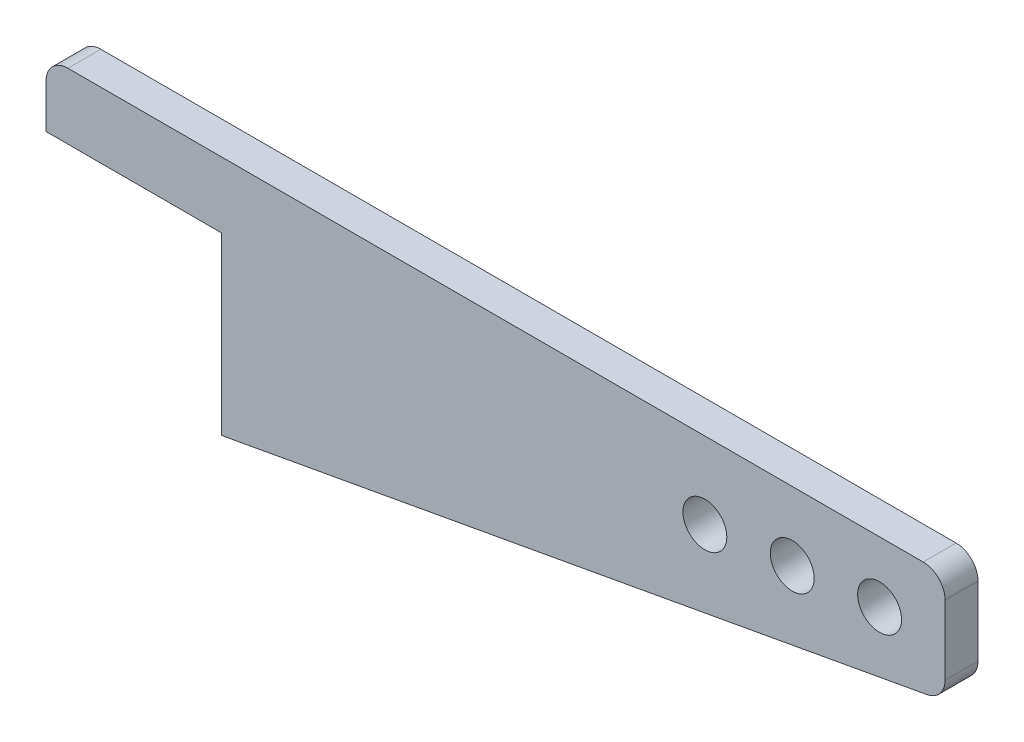
ISO-10303-21;
HEADER;
FILE_DESCRIPTION(('STEP AP214'),'2;1');
FILE_NAME('part.step','',(''),(''),'','','');
FILE_SCHEMA(('AUTOMOTIVE_DESIGN { 1 0 10303 214 1 1 1 1 }'));
ENDSEC;
DATA;
#1=APPLICATION_CONTEXT('core data for automotive mechanical design processes');
#2=APPLICATION_PROTOCOL_DEFINITION('international standard','automotive_design',2000,#1);
#3=PRODUCT_CONTEXT('',#1,'mechanical');
#4=PRODUCT('Part','Part','',(#3));
#5=PRODUCT_RELATED_PRODUCT_CATEGORY('part','',(#4));
#6=PRODUCT_DEFINITION_FORMATION('','',#4);
#7=PRODUCT_DEFINITION_CONTEXT('part definition',#1,'design');
#8=PRODUCT_DEFINITION('design','',#6,#7);
#9=PRODUCT_DEFINITION_SHAPE('','',#8);
#10=(LENGTH_UNIT() NAMED_UNIT(*) SI_UNIT(.MILLI.,.METRE.));
#11=(NAMED_UNIT(*) PLANE_ANGLE_UNIT() SI_UNIT($,.RADIAN.));
#12=(NAMED_UNIT(*) SI_UNIT($,.STERADIAN.) SOLID_ANGLE_UNIT());
#13=UNCERTAINTY_MEASURE_WITH_UNIT(LENGTH_MEASURE(1.E-05),#10,'distance_accuracy_value','');
#14=(GEOMETRIC_REPRESENTATION_CONTEXT(3) GLOBAL_UNCERTAINTY_ASSIGNED_CONTEXT((#13)) GLOBAL_UNIT_ASSIGNED_CONTEXT((#10,
#11,#12)) REPRESENTATION_CONTEXT('',''));
#15=CARTESIAN_POINT('',(0.,0.,0.));
#16=DIRECTION('',(0.,0.,1.));
#17=DIRECTION('',(1.,0.,0.));
#18=AXIS2_PLACEMENT_3D('',#15,#16,#17);
#19=CARTESIAN_POINT('',(-3.33066907387547E-13,-1.77635683940025E-12,15.));
#20=DIRECTION('',(0.,0.,-1.));
#21=DIRECTION('',(-1.,0.,0.));
#22=AXIS2_PLACEMENT_3D('',#19,#20,#21);
#23=PLANE('',#22);
#24=DIRECTION('',(-1.,0.,0.));
#25=VECTOR('',#24,1.);
#26=CARTESIAN_POINT('',(-3.33066907387547E-13,-1.77635683940025E-12,15.));
#27=LINE('',#26,#25);
#28=CARTESIAN_POINT('',(400.,-5.10702591327572E-12,15.));
#29=VERTEX_POINT('',#28);
#30=CARTESIAN_POINT('',(9.99999999999968,-3.10862446895044E-12,15.));
#31=VERTEX_POINT('',#30);
#32=EDGE_CURVE('E201',#29,#31,#27,.T.);
#33=ORIENTED_EDGE('',*,*,#32,.T.);
#34=CARTESIAN_POINT('',(9.99999999999973,-10.0000000000031,14.9999999999996));
#35=DIRECTION('',(0.,0.,-1.));
#36=DIRECTION('',(-1.,0.,0.));
#37=AXIS2_PLACEMENT_3D('',#34,#35,#36);
#38=CIRCLE('',#37,10.);
#39=CARTESIAN_POINT('',(-3.33066907387547E-13,-10.0000000000018,15.));
#40=VERTEX_POINT('',#39);
#41=EDGE_CURVE('E138',#31,#40,#38,.F.);
#42=ORIENTED_EDGE('',*,*,#41,.T.);
#43=DIRECTION('',(0.,-1.,0.));
#44=VECTOR('',#43,1.);
#45=CARTESIAN_POINT('',(0.,-30.0000000000018,15.));
#46=LINE('',#45,#44);
#47=CARTESIAN_POINT('',(0.,-30.0000000000018,15.));
#48=VERTEX_POINT('',#47);
#49=EDGE_CURVE('E131',#40,#48,#46,.T.);
#50=ORIENTED_EDGE('',*,*,#49,.T.);
#51=DIRECTION('',(1.,0.,0.));
#52=VECTOR('',#51,1.);
#53=CARTESIAN_POINT('',(79.9999999999998,-30.0000000000039,15.0000000000001));
#54=LINE('',#53,#52);
#55=CARTESIAN_POINT('',(79.9999999999998,-30.0000000000039,15.0000000000001));
#56=VERTEX_POINT('',#55);
#57=EDGE_CURVE('E135',#48,#56,#54,.T.);
#58=ORIENTED_EDGE('',*,*,#57,.T.);
#59=DIRECTION('',(0.,-1.,0.));
#60=VECTOR('',#59,1.);
#61=CARTESIAN_POINT('',(80.,-110.000000000004,14.9999999999998));
#62=LINE('',#61,#60);
#63=CARTESIAN_POINT('',(80.,-110.000000000004,14.9999999999998));
#64=VERTEX_POINT('',#63);
#65=EDGE_CURVE('E152',#56,#64,#62,.T.);
#66=ORIENTED_EDGE('',*,*,#65,.T.);
#67=DIRECTION('',(0.983869910099908,0.178885438199983,0.));
#68=VECTOR('',#67,1.);
#69=CARTESIAN_POINT('',(410.,-50.000000000005,14.9999999999996));
#70=LINE('',#69,#68);
#71=CARTESIAN_POINT('',(401.788854382,-51.4929355669123,15.0000000000003));
#72=VERTEX_POINT('',#71);
#73=EDGE_CURVE('E207',#64,#72,#70,.T.);
#74=ORIENTED_EDGE('',*,*,#73,.T.);
#75=CARTESIAN_POINT('',(400.,-41.6542364659151,15.0000000000001));
#76=DIRECTION('',(0.,0.,-1.));
#77=DIRECTION('',(-1.,0.,0.));
#78=AXIS2_PLACEMENT_3D('',#75,#76,#77);
#79=CIRCLE('',#78,10.);
#80=CARTESIAN_POINT('',(410.,-41.6542364659151,15.));
#81=VERTEX_POINT('',#80);
#82=EDGE_CURVE('E83',#72,#81,#79,.F.);
#83=ORIENTED_EDGE('',*,*,#82,.T.);
#84=DIRECTION('',(0.,1.,0.));
#85=VECTOR('',#84,1.);
#86=CARTESIAN_POINT('',(410.,-5.10702591327572E-12,15.0000000000001));
#87=LINE('',#86,#85);
#88=CARTESIAN_POINT('',(410.,-10.000000000005,14.9999999999999));
#89=VERTEX_POINT('',#88);
#90=EDGE_CURVE('E185',#81,#89,#87,.T.);
#91=ORIENTED_EDGE('',*,*,#90,.T.);
#92=CARTESIAN_POINT('',(400.,-10.0000000000051,15.0000000000001));
#93=DIRECTION('',(0.,0.,-1.));
#94=DIRECTION('',(-1.,0.,0.));
#95=AXIS2_PLACEMENT_3D('',#92,#93,#94);
#96=CIRCLE('',#95,10.);
#97=EDGE_CURVE('E176',#89,#29,#96,.F.);
#98=ORIENTED_EDGE('',*,*,#97,.T.);
#99=EDGE_LOOP('',(#33,#42,#50,#58,#66,#74,#83,#91,#98));
#100=FACE_BOUND('',#99,.T.);
#101=CARTESIAN_POINT('',(300.451747288552,-34.9589320646788,15.));
#102=DIRECTION('',(0.,0.,1.));
#103=DIRECTION('',(1.,0.,0.));
#104=AXIS2_PLACEMENT_3D('',#101,#102,#103);
#105=CIRCLE('',#104,9.99999999999998);
#106=CARTESIAN_POINT('',(310.451747288552,-34.9589320646788,15.));
#107=VERTEX_POINT('',#106);
#108=EDGE_CURVE('E213',#107,#107,#105,.T.);
#109=ORIENTED_EDGE('',*,*,#108,.F.);
#110=EDGE_LOOP('',(#109));
#111=FACE_BOUND('',#110,.T.);
#112=CARTESIAN_POINT('',(340.287475547261,-31.337502222978,15.));
#113=DIRECTION('',(0.,0.,1.));
#114=DIRECTION('',(1.,0.,0.));
#115=AXIS2_PLACEMENT_3D('',#112,#113,#114);
#116=CIRCLE('',#115,9.99999999999998);
#117=CARTESIAN_POINT('',(350.287475547261,-31.337502222978,15.));
#118=VERTEX_POINT('',#117);
#119=EDGE_CURVE('E322',#118,#118,#116,.T.);
#120=ORIENTED_EDGE('',*,*,#119,.F.);
#121=EDGE_LOOP('',(#120));
#122=FACE_BOUND('',#121,.T.);
#123=CARTESIAN_POINT('',(380.123203805969,-27.7160723812786,15.));
#124=DIRECTION('',(0.,0.,1.));
#125=DIRECTION('',(1.,0.,0.));
#126=AXIS2_PLACEMENT_3D('',#123,#124,#125);
#127=CIRCLE('',#126,10.);
#128=CARTESIAN_POINT('',(390.123203805969,-27.7160723812786,15.));
#129=VERTEX_POINT('',#128);
#130=EDGE_CURVE('E313',#129,#129,#127,.T.);
#131=ORIENTED_EDGE('',*,*,#130,.F.);
#132=EDGE_LOOP('',(#131));
#133=FACE_BOUND('',#132,.T.);
#134=ADVANCED_FACE('F61',(#100,#111,#122,#133),#23,.F.);
#135=CARTESIAN_POINT('',(0.,0.,0.));
#136=DIRECTION('',(0.,0.,-1.));
#137=DIRECTION('',(-1.,0.,0.));
#138=AXIS2_PLACEMENT_3D('',#135,#136,#137);
#139=PLANE('',#138);
#140=CARTESIAN_POINT('',(340.28747554726,-31.3375022229763,0.));
#141=DIRECTION('',(0.,0.,1.));
#142=DIRECTION('',(1.,0.,0.));
#143=AXIS2_PLACEMENT_3D('',#140,#141,#142);
#144=CIRCLE('',#143,9.99999999999998);
#145=CARTESIAN_POINT('',(350.28747554726,-31.3375022229763,0.));
#146=VERTEX_POINT('',#145);
#147=EDGE_CURVE('E319',#146,#146,#144,.T.);
#148=ORIENTED_EDGE('',*,*,#147,.T.);
#149=EDGE_LOOP('',(#148));
#150=FACE_BOUND('',#149,.T.);
#151=DIRECTION('',(0.,-1.,0.));
#152=VECTOR('',#151,1.);
#153=CARTESIAN_POINT('',(0.,-30.,0.));
#154=LINE('',#153,#152);
#155=CARTESIAN_POINT('',(0.,-10.,0.));
#156=VERTEX_POINT('',#155);
#157=CARTESIAN_POINT('',(0.,-30.,0.));
#158=VERTEX_POINT('',#157);
#159=EDGE_CURVE('E156',#156,#158,#154,.T.);
#160=ORIENTED_EDGE('',*,*,#159,.F.);
#161=CARTESIAN_POINT('',(10.0000000000001,-10.0000000000013,0.));
#162=DIRECTION('',(0.,0.,-1.));
#163=DIRECTION('',(-1.,0.,0.));
#164=AXIS2_PLACEMENT_3D('',#161,#162,#163);
#165=CIRCLE('',#164,10.);
#166=CARTESIAN_POINT('',(10.0000000000001,-1.33226762955019E-12,0.));
#167=VERTEX_POINT('',#166);
#168=EDGE_CURVE('E169',#156,#167,#165,.T.);
#169=ORIENTED_EDGE('',*,*,#168,.T.);
#170=DIRECTION('',(-1.,0.,0.));
#171=VECTOR('',#170,1.);
#172=CARTESIAN_POINT('',(0.,0.,0.));
#173=LINE('',#172,#171);
#174=CARTESIAN_POINT('',(399.999999999999,-3.33066907387547E-12,0.));
#175=VERTEX_POINT('',#174);
#176=EDGE_CURVE('E143',#175,#167,#173,.T.);
#177=ORIENTED_EDGE('',*,*,#176,.F.);
#178=CARTESIAN_POINT('',(399.999999999999,-10.0000000000033,4.44089209850063E-13));
#179=DIRECTION('',(0.,0.,-1.));
#180=DIRECTION('',(-1.,0.,0.));
#181=AXIS2_PLACEMENT_3D('',#178,#179,#180);
#182=CIRCLE('',#181,10.);
#183=CARTESIAN_POINT('',(409.999999999999,-10.0000000000033,0.));
#184=VERTEX_POINT('',#183);
#185=EDGE_CURVE('E160',#175,#184,#182,.T.);
#186=ORIENTED_EDGE('',*,*,#185,.T.);
#187=DIRECTION('',(0.,1.,0.));
#188=VECTOR('',#187,1.);
#189=CARTESIAN_POINT('',(409.999999999999,-3.33066907387547E-12,4.44089209850063E-13));
#190=LINE('',#189,#188);
#191=CARTESIAN_POINT('',(410.,-41.6542364659134,0.));
#192=VERTEX_POINT('',#191);
#193=EDGE_CURVE('E184',#192,#184,#190,.T.);
#194=ORIENTED_EDGE('',*,*,#193,.F.);
#195=CARTESIAN_POINT('',(400.,-41.6542364659134,4.44089209850063E-13));
#196=DIRECTION('',(0.,0.,-1.));
#197=DIRECTION('',(-1.,0.,0.));
#198=AXIS2_PLACEMENT_3D('',#195,#196,#197);
#199=CIRCLE('',#198,10.);
#200=CARTESIAN_POINT('',(401.788854381999,-51.4929355669105,2.77555756156289E-13));
#201=VERTEX_POINT('',#200);
#202=EDGE_CURVE('E167',#192,#201,#199,.T.);
#203=ORIENTED_EDGE('',*,*,#202,.T.);
#204=DIRECTION('',(0.983869910099908,0.178885438199983,0.));
#205=VECTOR('',#204,1.);
#206=CARTESIAN_POINT('',(410.,-50.0000000000033,0.));
#207=LINE('',#206,#205);
#208=CARTESIAN_POINT('',(80.0000000000001,-110.000000000003,0.));
#209=VERTEX_POINT('',#208);
#210=EDGE_CURVE('E193',#209,#201,#207,.T.);
#211=ORIENTED_EDGE('',*,*,#210,.F.);
#212=DIRECTION('',(0.,-1.,0.));
#213=VECTOR('',#212,1.);
#214=CARTESIAN_POINT('',(80.0000000000001,-110.000000000003,0.));
#215=LINE('',#214,#213);
#216=CARTESIAN_POINT('',(79.9999999999999,-30.0000000000032,0.));
#217=VERTEX_POINT('',#216);
#218=EDGE_CURVE('E197',#217,#209,#215,.T.);
#219=ORIENTED_EDGE('',*,*,#218,.F.);
#220=DIRECTION('',(1.,0.,0.));
#221=VECTOR('',#220,1.);
#222=CARTESIAN_POINT('',(79.9999999999999,-30.0000000000032,0.));
#223=LINE('',#222,#221);
#224=EDGE_CURVE('E212',#158,#217,#223,.T.);
#225=ORIENTED_EDGE('',*,*,#224,.F.);
#226=EDGE_LOOP('',(#160,#169,#177,#186,#194,#203,#211,#219,#225));
#227=FACE_BOUND('',#226,.T.);
#228=CARTESIAN_POINT('',(300.451747288551,-34.958932064677,0.));
#229=DIRECTION('',(0.,0.,1.));
#230=DIRECTION('',(1.,0.,0.));
#231=AXIS2_PLACEMENT_3D('',#228,#229,#230);
#232=CIRCLE('',#231,9.99999999999998);
#233=CARTESIAN_POINT('',(310.451747288551,-34.958932064677,0.));
#234=VERTEX_POINT('',#233);
#235=EDGE_CURVE('E325',#234,#234,#232,.T.);
#236=ORIENTED_EDGE('',*,*,#235,.T.);
#237=EDGE_LOOP('',(#236));
#238=FACE_BOUND('',#237,.T.);
#239=CARTESIAN_POINT('',(380.123203805969,-27.7160723812768,0.));
#240=DIRECTION('',(0.,0.,1.));
#241=DIRECTION('',(1.,0.,0.));
#242=AXIS2_PLACEMENT_3D('',#239,#240,#241);
#243=CIRCLE('',#242,10.);
#244=CARTESIAN_POINT('',(390.123203805969,-27.7160723812768,0.));
#245=VERTEX_POINT('',#244);
#246=EDGE_CURVE('E316',#245,#245,#243,.T.);
#247=ORIENTED_EDGE('',*,*,#246,.T.);
#248=EDGE_LOOP('',(#247));
#249=FACE_BOUND('',#248,.T.);
#250=ADVANCED_FACE('F188',(#150,#227,#238,#249),#139,.T.);
#251=CARTESIAN_POINT('',(0.,-30.0000000000018,15.));
#252=DIRECTION('',(1.,0.,0.));
#253=DIRECTION('',(0.,1.,0.));
#254=AXIS2_PLACEMENT_3D('',#251,#252,#253);
#255=PLANE('',#254);
#256=ORIENTED_EDGE('',*,*,#49,.F.);
#257=DIRECTION('',(0.,0.,-1.));
#258=VECTOR('',#257,1.);
#259=CARTESIAN_POINT('',(-3.33066907387547E-13,-10.0000000000018,15.));
#260=LINE('',#259,#258);
#261=EDGE_CURVE('E158',#40,#156,#260,.T.);
#262=ORIENTED_EDGE('',*,*,#261,.T.);
#263=ORIENTED_EDGE('',*,*,#159,.T.);
#264=DIRECTION('',(0.,0.,-1.));
#265=VECTOR('',#264,1.);
#266=CARTESIAN_POINT('',(0.,-30.0000000000018,15.));
#267=LINE('',#266,#265);
#268=EDGE_CURVE('E148',#48,#158,#267,.T.);
#269=ORIENTED_EDGE('',*,*,#268,.F.);
#270=EDGE_LOOP('',(#256,#262,#263,#269));
#271=FACE_BOUND('',#270,.T.);
#272=ADVANCED_FACE('F154',(#271),#255,.F.);
#273=CARTESIAN_POINT('',(79.9999999999998,-30.0000000000039,15.0000000000001));
#274=DIRECTION('',(0.,1.,0.));
#275=DIRECTION('',(0.,0.,1.));
#276=AXIS2_PLACEMENT_3D('',#273,#274,#275);
#277=PLANE('',#276);
#278=ORIENTED_EDGE('',*,*,#224,.T.);
#279=DIRECTION('',(0.,0.,-1.));
#280=VECTOR('',#279,1.);
#281=CARTESIAN_POINT('',(79.9999999999998,-30.0000000000039,15.0000000000001));
#282=LINE('',#281,#280);
#283=EDGE_CURVE('E150',#56,#217,#282,.T.);
#284=ORIENTED_EDGE('',*,*,#283,.F.);
#285=ORIENTED_EDGE('',*,*,#57,.F.);
#286=ORIENTED_EDGE('',*,*,#268,.T.);
#287=EDGE_LOOP('',(#278,#284,#285,#286));
#288=FACE_BOUND('',#287,.T.);
#289=ADVANCED_FACE('F147',(#288),#277,.F.);
#290=CARTESIAN_POINT('',(80.,-110.000000000004,14.9999999999998));
#291=DIRECTION('',(1.,0.,0.));
#292=DIRECTION('',(0.,1.,0.));
#293=AXIS2_PLACEMENT_3D('',#290,#291,#292);
#294=PLANE('',#293);
#295=ORIENTED_EDGE('',*,*,#218,.T.);
#296=DIRECTION('',(0.,0.,-1.));
#297=VECTOR('',#296,1.);
#298=CARTESIAN_POINT('',(80.,-110.000000000004,14.9999999999998));
#299=LINE('',#298,#297);
#300=EDGE_CURVE('E162',#64,#209,#299,.T.);
#301=ORIENTED_EDGE('',*,*,#300,.F.);
#302=ORIENTED_EDGE('',*,*,#65,.F.);
#303=ORIENTED_EDGE('',*,*,#283,.T.);
#304=EDGE_LOOP('',(#295,#301,#302,#303));
#305=FACE_BOUND('',#304,.T.);
#306=ADVANCED_FACE('F216',(#305),#294,.F.);
#307=CARTESIAN_POINT('',(410.,-50.000000000005,14.9999999999996));
#308=DIRECTION('',(-0.178885438199983,0.983869910099907,0.));
#309=DIRECTION('',(-0.983869910099907,-0.178885438199983,0.));
#310=AXIS2_PLACEMENT_3D('',#307,#308,#309);
#311=PLANE('',#310);
#312=ORIENTED_EDGE('',*,*,#210,.T.);
#313=DIRECTION('',(0.,0.,-1.));
#314=VECTOR('',#313,1.);
#315=CARTESIAN_POINT('',(401.788854382,-51.4929355669123,15.0000000000003));
#316=LINE('',#315,#314);
#317=EDGE_CURVE('E14',#201,#72,#316,.F.);
#318=ORIENTED_EDGE('',*,*,#317,.T.);
#319=ORIENTED_EDGE('',*,*,#73,.F.);
#320=ORIENTED_EDGE('',*,*,#300,.T.);
#321=EDGE_LOOP('',(#312,#318,#319,#320));
#322=FACE_BOUND('',#321,.T.);
#323=ADVANCED_FACE('F218',(#322),#311,.F.);
#324=CARTESIAN_POINT('',(410.,-5.10702591327572E-12,15.0000000000001));
#325=DIRECTION('',(-1.,0.,0.));
#326=DIRECTION('',(0.,-1.,0.));
#327=AXIS2_PLACEMENT_3D('',#324,#325,#326);
#328=PLANE('',#327);
#329=ORIENTED_EDGE('',*,*,#90,.F.);
#330=DIRECTION('',(0.,0.,-1.));
#331=VECTOR('',#330,1.);
#332=CARTESIAN_POINT('',(410.,-41.6542364659151,15.));
#333=LINE('',#332,#331);
#334=EDGE_CURVE('E69',#81,#192,#333,.T.);
#335=ORIENTED_EDGE('',*,*,#334,.T.);
#336=ORIENTED_EDGE('',*,*,#193,.T.);
#337=DIRECTION('',(0.,0.,-1.));
#338=VECTOR('',#337,1.);
#339=CARTESIAN_POINT('',(410.,-10.000000000005,14.9999999999999));
#340=LINE('',#339,#338);
#341=EDGE_CURVE('E76',#184,#89,#340,.F.);
#342=ORIENTED_EDGE('',*,*,#341,.T.);
#343=EDGE_LOOP('',(#329,#335,#336,#342));
#344=FACE_BOUND('',#343,.T.);
#345=ADVANCED_FACE('F183',(#344),#328,.F.);
#346=CARTESIAN_POINT('',(-3.33066907387547E-13,-1.77635683940025E-12,15.));
#347=DIRECTION('',(0.,-1.,0.));
#348=DIRECTION('',(0.,0.,-1.));
#349=AXIS2_PLACEMENT_3D('',#346,#347,#348);
#350=PLANE('',#349);
#351=ORIENTED_EDGE('',*,*,#176,.T.);
#352=DIRECTION('',(0.,0.,-1.));
#353=VECTOR('',#352,1.);
#354=CARTESIAN_POINT('',(9.99999999999968,-3.10862446895044E-12,15.));
#355=LINE('',#354,#353);
#356=EDGE_CURVE('E174',#167,#31,#355,.F.);
#357=ORIENTED_EDGE('',*,*,#356,.T.);
#358=ORIENTED_EDGE('',*,*,#32,.F.);
#359=DIRECTION('',(0.,0.,-1.));
#360=VECTOR('',#359,1.);
#361=CARTESIAN_POINT('',(400.,-5.10702591327572E-12,15.));
#362=LINE('',#361,#360);
#363=EDGE_CURVE('E171',#29,#175,#362,.T.);
#364=ORIENTED_EDGE('',*,*,#363,.T.);
#365=EDGE_LOOP('',(#351,#357,#358,#364));
#366=FACE_BOUND('',#365,.T.);
#367=ADVANCED_FACE('F241',(#366),#350,.F.);
#368=CARTESIAN_POINT('',(300.451747288552,-34.9589320646788,15.));
#369=DIRECTION('',(0.,0.,-1.));
#370=DIRECTION('',(-1.,0.,0.));
#371=AXIS2_PLACEMENT_3D('',#368,#369,#370);
#372=CYLINDRICAL_SURFACE('',#371,9.99999999999998);
#373=ORIENTED_EDGE('',*,*,#108,.T.);
#374=EDGE_LOOP('',(#373));
#375=FACE_BOUND('',#374,.T.);
#376=ORIENTED_EDGE('',*,*,#235,.F.);
#377=EDGE_LOOP('',(#376));
#378=FACE_BOUND('',#377,.T.);
#379=ADVANCED_FACE('F238',(#375,#378),#372,.F.);
#380=CARTESIAN_POINT('',(340.287475547261,-31.337502222978,15.));
#381=DIRECTION('',(0.,0.,-1.));
#382=DIRECTION('',(-1.,0.,0.));
#383=AXIS2_PLACEMENT_3D('',#380,#381,#382);
#384=CYLINDRICAL_SURFACE('',#383,9.99999999999998);
#385=ORIENTED_EDGE('',*,*,#119,.T.);
#386=EDGE_LOOP('',(#385));
#387=FACE_BOUND('',#386,.T.);
#388=ORIENTED_EDGE('',*,*,#147,.F.);
#389=EDGE_LOOP('',(#388));
#390=FACE_BOUND('',#389,.T.);
#391=ADVANCED_FACE('F284',(#387,#390),#384,.F.);
#392=CARTESIAN_POINT('',(380.123203805969,-27.7160723812786,15.));
#393=DIRECTION('',(0.,0.,-1.));
#394=DIRECTION('',(-1.,0.,0.));
#395=AXIS2_PLACEMENT_3D('',#392,#393,#394);
#396=CYLINDRICAL_SURFACE('',#395,10.);
#397=ORIENTED_EDGE('',*,*,#130,.T.);
#398=EDGE_LOOP('',(#397));
#399=FACE_BOUND('',#398,.T.);
#400=ORIENTED_EDGE('',*,*,#246,.F.);
#401=EDGE_LOOP('',(#400));
#402=FACE_BOUND('',#401,.T.);
#403=ADVANCED_FACE('F227',(#399,#402),#396,.F.);
#404=CARTESIAN_POINT('',(9.99999999999973,-10.0000000000031,14.9999999999996));
#405=DIRECTION('',(0.,0.,-1.));
#406=DIRECTION('',(-1.,0.,0.));
#407=AXIS2_PLACEMENT_3D('',#404,#405,#406);
#408=CYLINDRICAL_SURFACE('',#407,10.);
#409=ORIENTED_EDGE('',*,*,#41,.F.);
#410=ORIENTED_EDGE('',*,*,#356,.F.);
#411=ORIENTED_EDGE('',*,*,#168,.F.);
#412=ORIENTED_EDGE('',*,*,#261,.F.);
#413=EDGE_LOOP('',(#409,#410,#411,#412));
#414=FACE_BOUND('',#413,.T.);
#415=ADVANCED_FACE('F221',(#414),#408,.T.);
#416=CARTESIAN_POINT('',(400.,-41.6542364659151,15.0000000000001));
#417=DIRECTION('',(0.,0.,-1.));
#418=DIRECTION('',(-1.,0.,0.));
#419=AXIS2_PLACEMENT_3D('',#416,#417,#418);
#420=CYLINDRICAL_SURFACE('',#419,10.);
#421=ORIENTED_EDGE('',*,*,#82,.F.);
#422=ORIENTED_EDGE('',*,*,#317,.F.);
#423=ORIENTED_EDGE('',*,*,#202,.F.);
#424=ORIENTED_EDGE('',*,*,#334,.F.);
#425=EDGE_LOOP('',(#421,#422,#423,#424));
#426=FACE_BOUND('',#425,.T.);
#427=ADVANCED_FACE('F219',(#426),#420,.T.);
#428=CARTESIAN_POINT('',(400.,-10.0000000000051,15.0000000000001));
#429=DIRECTION('',(0.,0.,-1.));
#430=DIRECTION('',(-1.,0.,0.));
#431=AXIS2_PLACEMENT_3D('',#428,#429,#430);
#432=CYLINDRICAL_SURFACE('',#431,10.);
#433=ORIENTED_EDGE('',*,*,#97,.F.);
#434=ORIENTED_EDGE('',*,*,#341,.F.);
#435=ORIENTED_EDGE('',*,*,#185,.F.);
#436=ORIENTED_EDGE('',*,*,#363,.F.);
#437=EDGE_LOOP('',(#433,#434,#435,#436));
#438=FACE_BOUND('',#437,.T.);
#439=ADVANCED_FACE('F63',(#438),#432,.T.);
#440=CLOSED_SHELL('',(#134,#250,#272,#289,#306,#323,#345,#367,#379,#391,#403,#415,#427,#439));
#441=MANIFOLD_SOLID_BREP('B2',#440);
#442=ADVANCED_BREP_SHAPE_REPRESENTATION('',(#18,#441),#14);
#443=SHAPE_DEFINITION_REPRESENTATION(#9,#442);
ENDSEC;
END-ISO-10303-21;
